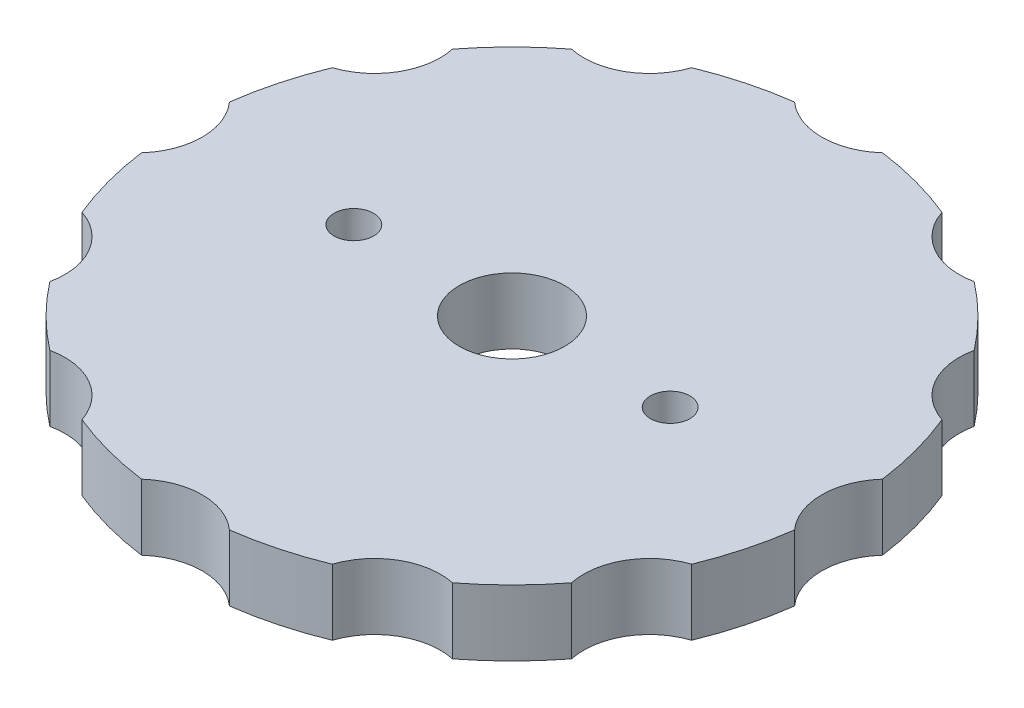
ISO-10303-21;
HEADER;
FILE_DESCRIPTION(('STEP AP214'),'2;1');
FILE_NAME('part.step','',(''),(''),'','','');
FILE_SCHEMA(('AUTOMOTIVE_DESIGN { 1 0 10303 214 1 1 1 1 }'));
ENDSEC;
DATA;
#1=APPLICATION_CONTEXT('core data for automotive mechanical design processes');
#2=APPLICATION_PROTOCOL_DEFINITION('international standard','automotive_design',2000,#1);
#3=PRODUCT_CONTEXT('',#1,'mechanical');
#4=PRODUCT('Part','Part','',(#3));
#5=PRODUCT_RELATED_PRODUCT_CATEGORY('part','',(#4));
#6=PRODUCT_DEFINITION_FORMATION('','',#4);
#7=PRODUCT_DEFINITION_CONTEXT('part definition',#1,'design');
#8=PRODUCT_DEFINITION('design','',#6,#7);
#9=PRODUCT_DEFINITION_SHAPE('','',#8);
#10=(LENGTH_UNIT() NAMED_UNIT(*) SI_UNIT(.MILLI.,.METRE.));
#11=(NAMED_UNIT(*) PLANE_ANGLE_UNIT() SI_UNIT($,.RADIAN.));
#12=(NAMED_UNIT(*) SI_UNIT($,.STERADIAN.) SOLID_ANGLE_UNIT());
#13=UNCERTAINTY_MEASURE_WITH_UNIT(LENGTH_MEASURE(1.E-05),#10,'distance_accuracy_value','');
#14=(GEOMETRIC_REPRESENTATION_CONTEXT(3) GLOBAL_UNCERTAINTY_ASSIGNED_CONTEXT((#13)) GLOBAL_UNIT_ASSIGNED_CONTEXT((#10,
#11,#12)) REPRESENTATION_CONTEXT('',''));
#15=CARTESIAN_POINT('',(0.,0.,0.));
#16=DIRECTION('',(0.,0.,1.));
#17=DIRECTION('',(1.,0.,0.));
#18=AXIS2_PLACEMENT_3D('',#15,#16,#17);
#19=CARTESIAN_POINT('',(0.,5.,0.));
#20=DIRECTION('',(0.,1.,0.));
#21=DIRECTION('',(0.,0.,1.));
#22=AXIS2_PLACEMENT_3D('',#19,#20,#21);
#23=PLANE('',#22);
#24=CARTESIAN_POINT('',(12.,5.,0.));
#25=DIRECTION('',(0.,1.,0.));
#26=DIRECTION('',(0.,0.,-1.));
#27=AXIS2_PLACEMENT_3D('',#24,#25,#26);
#28=CIRCLE('',#27,1.5);
#29=CARTESIAN_POINT('',(12.,5.,-1.5));
#30=VERTEX_POINT('',#29);
#31=EDGE_CURVE('E340',#30,#30,#28,.T.);
#32=ORIENTED_EDGE('',*,*,#31,.F.);
#33=EDGE_LOOP('',(#32));
#34=FACE_BOUND('',#33,.T.);
#35=CARTESIAN_POINT('',(-12.,5.,0.));
#36=DIRECTION('',(0.,1.,0.));
#37=DIRECTION('',(0.,0.,1.));
#38=AXIS2_PLACEMENT_3D('',#35,#36,#37);
#39=CIRCLE('',#38,1.5);
#40=CARTESIAN_POINT('',(-12.,5.,1.5));
#41=VERTEX_POINT('',#40);
#42=EDGE_CURVE('E334',#41,#41,#39,.T.);
#43=ORIENTED_EDGE('',*,*,#42,.F.);
#44=EDGE_LOOP('',(#43));
#45=FACE_BOUND('',#44,.T.);
#46=CARTESIAN_POINT('',(0.,5.,0.));
#47=DIRECTION('',(0.,1.,0.));
#48=DIRECTION('',(0.,0.,1.));
#49=AXIS2_PLACEMENT_3D('',#46,#47,#48);
#50=CIRCLE('',#49,25.);
#51=CARTESIAN_POINT('',(19.7885232568087,5.,-15.2779038913963));
#52=VERTEX_POINT('',#51);
#53=CARTESIAN_POINT('',(15.2779038913958,5.,-19.7885232568091));
#54=VERTEX_POINT('',#53);
#55=EDGE_CURVE('E205',#52,#54,#50,.T.);
#56=ORIENTED_EDGE('',*,*,#55,.T.);
#57=CARTESIAN_POINT('',(14.2499999999997,5.,-24.6817240078567));
#58=DIRECTION('',(0.,1.,0.));
#59=DIRECTION('',(-0.499999999999989,0.,0.866025403784445));
#60=AXIS2_PLACEMENT_3D('',#57,#58,#59);
#61=CIRCLE('',#60,5.);
#62=CARTESIAN_POINT('',(9.49841189807736,5.,-23.1253145149307));
#63=VERTEX_POINT('',#62);
#64=EDGE_CURVE('E191',#63,#54,#61,.T.);
#65=ORIENTED_EDGE('',*,*,#64,.F.);
#66=CARTESIAN_POINT('',(3.33679125812165,5.,-24.7763157894737));
#67=VERTEX_POINT('',#66);
#68=EDGE_CURVE('E214',#63,#67,#50,.T.);
#69=ORIENTED_EDGE('',*,*,#68,.T.);
#70=CARTESIAN_POINT('',(0.,5.,-28.5));
#71=DIRECTION('',(0.,1.,0.));
#72=DIRECTION('',(0.,0.,1.));
#73=AXIS2_PLACEMENT_3D('',#70,#71,#72);
#74=CIRCLE('',#73,5.);
#75=CARTESIAN_POINT('',(-3.33679125812165,5.,-24.7763157894737));
#76=VERTEX_POINT('',#75);
#77=EDGE_CURVE('E266',#76,#67,#74,.T.);
#78=ORIENTED_EDGE('',*,*,#77,.F.);
#79=CARTESIAN_POINT('',(-9.49841189807768,5.,-23.1253145149305));
#80=VERTEX_POINT('',#79);
#81=EDGE_CURVE('E218',#76,#80,#50,.T.);
#82=ORIENTED_EDGE('',*,*,#81,.T.);
#83=CARTESIAN_POINT('',(-14.25,5.,-24.6817240078565));
#84=DIRECTION('',(0.,1.,0.));
#85=DIRECTION('',(0.500000000000001,0.,0.866025403784438));
#86=AXIS2_PLACEMENT_3D('',#83,#84,#85);
#87=CIRCLE('',#86,5.);
#88=CARTESIAN_POINT('',(-15.2779038913961,5.,-19.7885232568089));
#89=VERTEX_POINT('',#88);
#90=EDGE_CURVE('E275',#89,#80,#87,.T.);
#91=ORIENTED_EDGE('',*,*,#90,.F.);
#92=CARTESIAN_POINT('',(-19.7885232568089,5.,-15.277903891396));
#93=VERTEX_POINT('',#92);
#94=EDGE_CURVE('E223',#89,#93,#50,.T.);
#95=ORIENTED_EDGE('',*,*,#94,.T.);
#96=CARTESIAN_POINT('',(-24.6817240078565,5.,-14.2499999999999));
#97=DIRECTION('',(0.,1.,0.));
#98=DIRECTION('',(0.86602540378444,0.,0.499999999999998));
#99=AXIS2_PLACEMENT_3D('',#96,#97,#98);
#100=CIRCLE('',#99,5.);
#101=CARTESIAN_POINT('',(-23.1253145149306,5.,-9.4984118980776));
#102=VERTEX_POINT('',#101);
#103=EDGE_CURVE('E281',#102,#93,#100,.T.);
#104=ORIENTED_EDGE('',*,*,#103,.F.);
#105=CARTESIAN_POINT('',(-24.7763157894737,5.,-3.33679125812157));
#106=VERTEX_POINT('',#105);
#107=EDGE_CURVE('E443',#102,#106,#50,.T.);
#108=ORIENTED_EDGE('',*,*,#107,.T.);
#109=CARTESIAN_POINT('',(-28.5,5.,0.));
#110=DIRECTION('',(0.,1.,0.));
#111=DIRECTION('',(1.,0.,0.));
#112=AXIS2_PLACEMENT_3D('',#109,#110,#111);
#113=CIRCLE('',#112,5.);
#114=CARTESIAN_POINT('',(-24.7763157894737,5.,3.33679125812174));
#115=VERTEX_POINT('',#114);
#116=EDGE_CURVE('E287',#115,#106,#113,.T.);
#117=ORIENTED_EDGE('',*,*,#116,.F.);
#118=CARTESIAN_POINT('',(-23.1253145149305,5.,9.49841189807777));
#119=VERTEX_POINT('',#118);
#120=EDGE_CURVE('E445',#115,#119,#50,.T.);
#121=ORIENTED_EDGE('',*,*,#120,.T.);
#122=CARTESIAN_POINT('',(-24.6817240078564,5.,14.2500000000001));
#123=DIRECTION('',(0.,1.,0.));
#124=DIRECTION('',(0.866025403784436,0.,-0.500000000000004));
#125=AXIS2_PLACEMENT_3D('',#122,#123,#124);
#126=CIRCLE('',#125,5.);
#127=CARTESIAN_POINT('',(-19.7885232568088,5.,15.2779038913961));
#128=VERTEX_POINT('',#127);
#129=EDGE_CURVE('E293',#128,#119,#126,.T.);
#130=ORIENTED_EDGE('',*,*,#129,.F.);
#131=CARTESIAN_POINT('',(-15.2779038913959,5.,19.788523256809));
#132=VERTEX_POINT('',#131);
#133=EDGE_CURVE('E449',#128,#132,#50,.T.);
#134=ORIENTED_EDGE('',*,*,#133,.T.);
#135=CARTESIAN_POINT('',(-14.2499999999999,5.,24.6817240078566));
#136=DIRECTION('',(0.,1.,0.));
#137=DIRECTION('',(0.499999999999995,0.,-0.866025403784442));
#138=AXIS2_PLACEMENT_3D('',#135,#136,#137);
#139=CIRCLE('',#138,5.);
#140=CARTESIAN_POINT('',(-9.49841189807752,5.,23.1253145149306));
#141=VERTEX_POINT('',#140);
#142=EDGE_CURVE('E299',#141,#132,#139,.T.);
#143=ORIENTED_EDGE('',*,*,#142,.F.);
#144=CARTESIAN_POINT('',(-3.33679125812165,5.,24.7763157894737));
#145=VERTEX_POINT('',#144);
#146=EDGE_CURVE('E453',#141,#145,#50,.T.);
#147=ORIENTED_EDGE('',*,*,#146,.T.);
#148=CARTESIAN_POINT('',(0.,5.,28.5));
#149=DIRECTION('',(0.,1.,0.));
#150=DIRECTION('',(0.,0.,-1.));
#151=AXIS2_PLACEMENT_3D('',#148,#149,#150);
#152=CIRCLE('',#151,5.);
#153=CARTESIAN_POINT('',(3.33679125812165,5.,24.7763157894737));
#154=VERTEX_POINT('',#153);
#155=EDGE_CURVE('E305',#154,#145,#152,.T.);
#156=ORIENTED_EDGE('',*,*,#155,.F.);
#157=CARTESIAN_POINT('',(9.49841189807785,5.,23.1253145149305));
#158=VERTEX_POINT('',#157);
#159=EDGE_CURVE('E457',#154,#158,#50,.T.);
#160=ORIENTED_EDGE('',*,*,#159,.T.);
#161=CARTESIAN_POINT('',(14.2500000000002,5.,24.6817240078564));
#162=DIRECTION('',(0.,1.,0.));
#163=DIRECTION('',(-0.500000000000007,0.,-0.866025403784435));
#164=AXIS2_PLACEMENT_3D('',#161,#162,#163);
#165=CIRCLE('',#164,5.);
#166=CARTESIAN_POINT('',(15.2779038913962,5.,19.7885232568088));
#167=VERTEX_POINT('',#166);
#168=EDGE_CURVE('E311',#167,#158,#165,.T.);
#169=ORIENTED_EDGE('',*,*,#168,.F.);
#170=CARTESIAN_POINT('',(19.788523256809,5.,15.2779038913958));
#171=VERTEX_POINT('',#170);
#172=EDGE_CURVE('E461',#167,#171,#50,.T.);
#173=ORIENTED_EDGE('',*,*,#172,.T.);
#174=CARTESIAN_POINT('',(24.6817240078566,5.,14.2499999999998));
#175=DIRECTION('',(0.,1.,0.));
#176=DIRECTION('',(-0.866025403784443,0.,-0.499999999999992));
#177=AXIS2_PLACEMENT_3D('',#174,#175,#176);
#178=CIRCLE('',#177,5.);
#179=CARTESIAN_POINT('',(23.1253145149306,5.,9.49841189807744));
#180=VERTEX_POINT('',#179);
#181=EDGE_CURVE('E317',#180,#171,#178,.T.);
#182=ORIENTED_EDGE('',*,*,#181,.F.);
#183=CARTESIAN_POINT('',(24.7763157894737,5.,3.33679125812139));
#184=VERTEX_POINT('',#183);
#185=EDGE_CURVE('E216',#180,#184,#50,.T.);
#186=ORIENTED_EDGE('',*,*,#185,.T.);
#187=CARTESIAN_POINT('',(28.5,5.,-2.98674735320981E-13));
#188=DIRECTION('',(0.,1.,0.));
#189=DIRECTION('',(-1.,0.,0.));
#190=AXIS2_PLACEMENT_3D('',#187,#188,#189);
#191=CIRCLE('',#190,5.);
#192=CARTESIAN_POINT('',(24.7763157894737,5.,-3.33679125812191));
#193=VERTEX_POINT('',#192);
#194=EDGE_CURVE('E323',#193,#184,#191,.T.);
#195=ORIENTED_EDGE('',*,*,#194,.F.);
#196=CARTESIAN_POINT('',(23.1253145149304,5.,-9.49841189807793));
#197=VERTEX_POINT('',#196);
#198=EDGE_CURVE('E213',#193,#197,#50,.T.);
#199=ORIENTED_EDGE('',*,*,#198,.T.);
#200=CARTESIAN_POINT('',(24.6817240078563,5.,-14.2500000000003));
#201=DIRECTION('',(0.,1.,0.));
#202=DIRECTION('',(-0.866025403784433,0.,0.50000000000001));
#203=AXIS2_PLACEMENT_3D('',#200,#201,#202);
#204=CIRCLE('',#203,5.);
#205=EDGE_CURVE('E208',#52,#197,#204,.T.);
#206=ORIENTED_EDGE('',*,*,#205,.F.);
#207=EDGE_LOOP('',(#56,#65,#69,#78,#82,#91,#95,#104,#108,#117,#121,#130,#134,#143,#147,#156,
#160,#169,#173,#182,#186,#195,#199,#206));
#208=FACE_BOUND('',#207,.T.);
#209=CARTESIAN_POINT('',(0.,5.,0.));
#210=DIRECTION('',(0.,1.,0.));
#211=DIRECTION('',(0.,0.,1.));
#212=AXIS2_PLACEMENT_3D('',#209,#210,#211);
#213=CIRCLE('',#212,4.);
#214=CARTESIAN_POINT('',(0.,5.,4.));
#215=VERTEX_POINT('',#214);
#216=EDGE_CURVE('E198',#215,#215,#213,.T.);
#217=ORIENTED_EDGE('',*,*,#216,.F.);
#218=EDGE_LOOP('',(#217));
#219=FACE_BOUND('',#218,.T.);
#220=ADVANCED_FACE('F33',(#34,#45,#208,#219),#23,.T.);
#221=CARTESIAN_POINT('',(0.,0.,0.));
#222=DIRECTION('',(0.,1.,0.));
#223=DIRECTION('',(0.,0.,1.));
#224=AXIS2_PLACEMENT_3D('',#221,#222,#223);
#225=PLANE('',#224);
#226=CARTESIAN_POINT('',(12.,0.,0.));
#227=DIRECTION('',(0.,1.,0.));
#228=DIRECTION('',(0.,0.,-1.));
#229=AXIS2_PLACEMENT_3D('',#226,#227,#228);
#230=CIRCLE('',#229,1.5);
#231=CARTESIAN_POINT('',(12.,0.,-1.5));
#232=VERTEX_POINT('',#231);
#233=EDGE_CURVE('E337',#232,#232,#230,.T.);
#234=ORIENTED_EDGE('',*,*,#233,.T.);
#235=EDGE_LOOP('',(#234));
#236=FACE_BOUND('',#235,.T.);
#237=CARTESIAN_POINT('',(-12.,0.,0.));
#238=DIRECTION('',(0.,1.,0.));
#239=DIRECTION('',(0.,0.,1.));
#240=AXIS2_PLACEMENT_3D('',#237,#238,#239);
#241=CIRCLE('',#240,1.5);
#242=CARTESIAN_POINT('',(-12.,0.,1.5));
#243=VERTEX_POINT('',#242);
#244=EDGE_CURVE('E331',#243,#243,#241,.T.);
#245=ORIENTED_EDGE('',*,*,#244,.T.);
#246=EDGE_LOOP('',(#245));
#247=FACE_BOUND('',#246,.T.);
#248=CARTESIAN_POINT('',(14.2499999999997,0.,-24.6817240078567));
#249=DIRECTION('',(0.,1.,0.));
#250=DIRECTION('',(0.,0.,1.));
#251=AXIS2_PLACEMENT_3D('',#248,#249,#250);
#252=CIRCLE('',#251,5.);
#253=CARTESIAN_POINT('',(15.2779038913958,0.,-19.7885232568091));
#254=VERTEX_POINT('',#253);
#255=CARTESIAN_POINT('',(9.49841189807736,0.,-23.1253145149307));
#256=VERTEX_POINT('',#255);
#257=EDGE_CURVE('E11',#254,#256,#252,.F.);
#258=ORIENTED_EDGE('',*,*,#257,.F.);
#259=CARTESIAN_POINT('',(0.,0.,0.));
#260=DIRECTION('',(0.,1.,0.));
#261=DIRECTION('',(0.,0.,1.));
#262=AXIS2_PLACEMENT_3D('',#259,#260,#261);
#263=CIRCLE('',#262,25.);
#264=CARTESIAN_POINT('',(19.7885232568087,0.,-15.2779038913963));
#265=VERTEX_POINT('',#264);
#266=EDGE_CURVE('E207',#265,#254,#263,.T.);
#267=ORIENTED_EDGE('',*,*,#266,.F.);
#268=CARTESIAN_POINT('',(24.6817240078563,0.,-14.2500000000003));
#269=DIRECTION('',(0.,1.,0.));
#270=DIRECTION('',(0.,0.,1.));
#271=AXIS2_PLACEMENT_3D('',#268,#269,#270);
#272=CIRCLE('',#271,5.);
#273=CARTESIAN_POINT('',(23.1253145149304,0.,-9.49841189807792));
#274=VERTEX_POINT('',#273);
#275=EDGE_CURVE('E41',#274,#265,#272,.F.);
#276=ORIENTED_EDGE('',*,*,#275,.F.);
#277=CARTESIAN_POINT('',(24.7763157894737,0.,-3.33679125812191));
#278=VERTEX_POINT('',#277);
#279=EDGE_CURVE('E257',#278,#274,#263,.T.);
#280=ORIENTED_EDGE('',*,*,#279,.F.);
#281=CARTESIAN_POINT('',(28.5,0.,-2.98674735320981E-13));
#282=DIRECTION('',(0.,1.,0.));
#283=DIRECTION('',(0.,0.,1.));
#284=AXIS2_PLACEMENT_3D('',#281,#282,#283);
#285=CIRCLE('',#284,5.);
#286=CARTESIAN_POINT('',(24.7763157894737,0.,3.33679125812139));
#287=VERTEX_POINT('',#286);
#288=EDGE_CURVE('E247',#287,#278,#285,.F.);
#289=ORIENTED_EDGE('',*,*,#288,.F.);
#290=CARTESIAN_POINT('',(23.1253145149306,0.,9.49841189807744));
#291=VERTEX_POINT('',#290);
#292=EDGE_CURVE('E258',#291,#287,#263,.T.);
#293=ORIENTED_EDGE('',*,*,#292,.F.);
#294=CARTESIAN_POINT('',(24.6817240078566,0.,14.2499999999998));
#295=DIRECTION('',(0.,1.,0.));
#296=DIRECTION('',(0.,0.,1.));
#297=AXIS2_PLACEMENT_3D('',#294,#295,#296);
#298=CIRCLE('',#297,5.);
#299=CARTESIAN_POINT('',(19.788523256809,0.,15.2779038913958));
#300=VERTEX_POINT('',#299);
#301=EDGE_CURVE('E245',#300,#291,#298,.F.);
#302=ORIENTED_EDGE('',*,*,#301,.F.);
#303=CARTESIAN_POINT('',(15.2779038913962,0.,19.7885232568088));
#304=VERTEX_POINT('',#303);
#305=EDGE_CURVE('E500',#304,#300,#263,.T.);
#306=ORIENTED_EDGE('',*,*,#305,.F.);
#307=CARTESIAN_POINT('',(14.2500000000002,0.,24.6817240078564));
#308=DIRECTION('',(0.,1.,0.));
#309=DIRECTION('',(0.,0.,1.));
#310=AXIS2_PLACEMENT_3D('',#307,#308,#309);
#311=CIRCLE('',#310,5.);
#312=CARTESIAN_POINT('',(9.49841189807786,0.,23.1253145149305));
#313=VERTEX_POINT('',#312);
#314=EDGE_CURVE('E243',#313,#304,#311,.F.);
#315=ORIENTED_EDGE('',*,*,#314,.F.);
#316=CARTESIAN_POINT('',(3.33679125812165,0.,24.7763157894737));
#317=VERTEX_POINT('',#316);
#318=EDGE_CURVE('E504',#317,#313,#263,.T.);
#319=ORIENTED_EDGE('',*,*,#318,.F.);
#320=CARTESIAN_POINT('',(0.,0.,28.5));
#321=DIRECTION('',(0.,1.,0.));
#322=DIRECTION('',(0.,0.,1.));
#323=AXIS2_PLACEMENT_3D('',#320,#321,#322);
#324=CIRCLE('',#323,5.);
#325=CARTESIAN_POINT('',(-3.33679125812165,0.,24.7763157894737));
#326=VERTEX_POINT('',#325);
#327=EDGE_CURVE('E241',#326,#317,#324,.F.);
#328=ORIENTED_EDGE('',*,*,#327,.F.);
#329=CARTESIAN_POINT('',(-9.49841189807752,0.,23.1253145149306));
#330=VERTEX_POINT('',#329);
#331=EDGE_CURVE('E505',#330,#326,#263,.T.);
#332=ORIENTED_EDGE('',*,*,#331,.F.);
#333=CARTESIAN_POINT('',(-14.2499999999999,0.,24.6817240078566));
#334=DIRECTION('',(0.,1.,0.));
#335=DIRECTION('',(0.,0.,1.));
#336=AXIS2_PLACEMENT_3D('',#333,#334,#335);
#337=CIRCLE('',#336,5.);
#338=CARTESIAN_POINT('',(-15.2779038913959,0.,19.788523256809));
#339=VERTEX_POINT('',#338);
#340=EDGE_CURVE('E239',#339,#330,#337,.F.);
#341=ORIENTED_EDGE('',*,*,#340,.F.);
#342=CARTESIAN_POINT('',(-19.7885232568088,0.,15.2779038913961));
#343=VERTEX_POINT('',#342);
#344=EDGE_CURVE('E509',#343,#339,#263,.T.);
#345=ORIENTED_EDGE('',*,*,#344,.F.);
#346=CARTESIAN_POINT('',(-24.6817240078564,0.,14.2500000000001));
#347=DIRECTION('',(0.,1.,0.));
#348=DIRECTION('',(0.,0.,1.));
#349=AXIS2_PLACEMENT_3D('',#346,#347,#348);
#350=CIRCLE('',#349,5.);
#351=CARTESIAN_POINT('',(-23.1253145149305,0.,9.49841189807778));
#352=VERTEX_POINT('',#351);
#353=EDGE_CURVE('E237',#352,#343,#350,.F.);
#354=ORIENTED_EDGE('',*,*,#353,.F.);
#355=CARTESIAN_POINT('',(-24.7763157894737,0.,3.33679125812174));
#356=VERTEX_POINT('',#355);
#357=EDGE_CURVE('E515',#356,#352,#263,.T.);
#358=ORIENTED_EDGE('',*,*,#357,.F.);
#359=CARTESIAN_POINT('',(-28.5,0.,0.));
#360=DIRECTION('',(0.,1.,0.));
#361=DIRECTION('',(0.,0.,1.));
#362=AXIS2_PLACEMENT_3D('',#359,#360,#361);
#363=CIRCLE('',#362,5.);
#364=CARTESIAN_POINT('',(-24.7763157894737,0.,-3.33679125812157));
#365=VERTEX_POINT('',#364);
#366=EDGE_CURVE('E235',#365,#356,#363,.F.);
#367=ORIENTED_EDGE('',*,*,#366,.F.);
#368=CARTESIAN_POINT('',(-23.1253145149306,0.,-9.4984118980776));
#369=VERTEX_POINT('',#368);
#370=EDGE_CURVE('E521',#369,#365,#263,.T.);
#371=ORIENTED_EDGE('',*,*,#370,.F.);
#372=CARTESIAN_POINT('',(-24.6817240078565,0.,-14.2499999999999));
#373=DIRECTION('',(0.,1.,0.));
#374=DIRECTION('',(0.,0.,1.));
#375=AXIS2_PLACEMENT_3D('',#372,#373,#374);
#376=CIRCLE('',#375,5.);
#377=CARTESIAN_POINT('',(-19.7885232568089,0.,-15.277903891396));
#378=VERTEX_POINT('',#377);
#379=EDGE_CURVE('E233',#378,#369,#376,.F.);
#380=ORIENTED_EDGE('',*,*,#379,.F.);
#381=CARTESIAN_POINT('',(-15.2779038913961,0.,-19.7885232568089));
#382=VERTEX_POINT('',#381);
#383=EDGE_CURVE('E228',#382,#378,#263,.T.);
#384=ORIENTED_EDGE('',*,*,#383,.F.);
#385=CARTESIAN_POINT('',(-14.25,0.,-24.6817240078565));
#386=DIRECTION('',(0.,1.,0.));
#387=DIRECTION('',(0.,0.,1.));
#388=AXIS2_PLACEMENT_3D('',#385,#386,#387);
#389=CIRCLE('',#388,5.);
#390=CARTESIAN_POINT('',(-9.49841189807768,0.,-23.1253145149305));
#391=VERTEX_POINT('',#390);
#392=EDGE_CURVE('E231',#391,#382,#389,.F.);
#393=ORIENTED_EDGE('',*,*,#392,.F.);
#394=CARTESIAN_POINT('',(-3.33679125812165,0.,-24.7763157894737));
#395=VERTEX_POINT('',#394);
#396=EDGE_CURVE('E217',#395,#391,#263,.T.);
#397=ORIENTED_EDGE('',*,*,#396,.F.);
#398=CARTESIAN_POINT('',(0.,0.,-28.5));
#399=DIRECTION('',(0.,1.,0.));
#400=DIRECTION('',(0.,0.,1.));
#401=AXIS2_PLACEMENT_3D('',#398,#399,#400);
#402=CIRCLE('',#401,5.);
#403=CARTESIAN_POINT('',(3.33679125812165,0.,-24.7763157894737));
#404=VERTEX_POINT('',#403);
#405=EDGE_CURVE('E222',#404,#395,#402,.F.);
#406=ORIENTED_EDGE('',*,*,#405,.F.);
#407=EDGE_CURVE('E229',#256,#404,#263,.T.);
#408=ORIENTED_EDGE('',*,*,#407,.F.);
#409=EDGE_LOOP('',(#258,#267,#276,#280,#289,#293,#302,#306,#315,#319,#328,#332,#341,#345,#354,
#358,#367,#371,#380,#384,#393,#397,#406,#408));
#410=FACE_BOUND('',#409,.T.);
#411=CARTESIAN_POINT('',(0.,0.,0.));
#412=DIRECTION('',(0.,1.,0.));
#413=DIRECTION('',(0.,0.,1.));
#414=AXIS2_PLACEMENT_3D('',#411,#412,#413);
#415=CIRCLE('',#414,4.);
#416=CARTESIAN_POINT('',(0.,0.,4.));
#417=VERTEX_POINT('',#416);
#418=EDGE_CURVE('E328',#417,#417,#415,.T.);
#419=ORIENTED_EDGE('',*,*,#418,.T.);
#420=EDGE_LOOP('',(#419));
#421=FACE_BOUND('',#420,.T.);
#422=ADVANCED_FACE('F254',(#236,#247,#410,#421),#225,.F.);
#423=CARTESIAN_POINT('',(0.,5.,0.));
#424=DIRECTION('',(0.,-1.,0.));
#425=DIRECTION('',(0.,0.,-1.));
#426=AXIS2_PLACEMENT_3D('',#423,#424,#425);
#427=CYLINDRICAL_SURFACE('',#426,25.);
#428=DIRECTION('',(0.,-1.,0.));
#429=VECTOR('',#428,1.);
#430=CARTESIAN_POINT('',(15.2779038913958,2.5,-19.7885232568091));
#431=LINE('',#430,#429);
#432=EDGE_CURVE('E47',#54,#254,#431,.T.);
#433=ORIENTED_EDGE('',*,*,#432,.F.);
#434=ORIENTED_EDGE('',*,*,#55,.F.);
#435=DIRECTION('',(0.,-1.,0.));
#436=VECTOR('',#435,1.);
#437=CARTESIAN_POINT('',(19.7885232568087,2.5,-15.2779038913963));
#438=LINE('',#437,#436);
#439=EDGE_CURVE('E249',#265,#52,#438,.F.);
#440=ORIENTED_EDGE('',*,*,#439,.F.);
#441=ORIENTED_EDGE('',*,*,#266,.T.);
#442=EDGE_LOOP('',(#433,#434,#440,#441));
#443=FACE_BOUND('',#442,.T.);
#444=ADVANCED_FACE('F203',(#443),#427,.T.);
#445=DIRECTION('',(0.,-1.,0.));
#446=VECTOR('',#445,1.);
#447=CARTESIAN_POINT('',(9.49841189807736,2.5,-23.1253145149307));
#448=LINE('',#447,#446);
#449=EDGE_CURVE('E194',#256,#63,#448,.F.);
#450=ORIENTED_EDGE('',*,*,#449,.F.);
#451=ORIENTED_EDGE('',*,*,#407,.T.);
#452=DIRECTION('',(0.,-1.,0.));
#453=VECTOR('',#452,1.);
#454=CARTESIAN_POINT('',(3.33679125812165,2.5,-24.7763157894737));
#455=LINE('',#454,#453);
#456=EDGE_CURVE('E224',#67,#404,#455,.T.);
#457=ORIENTED_EDGE('',*,*,#456,.F.);
#458=ORIENTED_EDGE('',*,*,#68,.F.);
#459=EDGE_LOOP('',(#450,#451,#457,#458));
#460=FACE_BOUND('',#459,.T.);
#461=ADVANCED_FACE('F417',(#460),#427,.T.);
#462=DIRECTION('',(0.,-1.,0.));
#463=VECTOR('',#462,1.);
#464=CARTESIAN_POINT('',(23.1253145149304,2.5,-9.49841189807793));
#465=LINE('',#464,#463);
#466=EDGE_CURVE('E55',#197,#274,#465,.T.);
#467=ORIENTED_EDGE('',*,*,#466,.F.);
#468=ORIENTED_EDGE('',*,*,#198,.F.);
#469=DIRECTION('',(0.,-1.,0.));
#470=VECTOR('',#469,1.);
#471=CARTESIAN_POINT('',(24.7763157894737,2.5,-3.33679125812191));
#472=LINE('',#471,#470);
#473=EDGE_CURVE('E321',#278,#193,#472,.F.);
#474=ORIENTED_EDGE('',*,*,#473,.F.);
#475=ORIENTED_EDGE('',*,*,#279,.T.);
#476=EDGE_LOOP('',(#467,#468,#474,#475));
#477=FACE_BOUND('',#476,.T.);
#478=ADVANCED_FACE('F421',(#477),#427,.T.);
#479=DIRECTION('',(0.,-1.,0.));
#480=VECTOR('',#479,1.);
#481=CARTESIAN_POINT('',(24.7763157894737,2.5,3.33679125812139));
#482=LINE('',#481,#480);
#483=EDGE_CURVE('E319',#184,#287,#482,.T.);
#484=ORIENTED_EDGE('',*,*,#483,.F.);
#485=ORIENTED_EDGE('',*,*,#185,.F.);
#486=DIRECTION('',(0.,-1.,0.));
#487=VECTOR('',#486,1.);
#488=CARTESIAN_POINT('',(23.1253145149306,2.5,9.49841189807744));
#489=LINE('',#488,#487);
#490=EDGE_CURVE('E315',#291,#180,#489,.F.);
#491=ORIENTED_EDGE('',*,*,#490,.F.);
#492=ORIENTED_EDGE('',*,*,#292,.T.);
#493=EDGE_LOOP('',(#484,#485,#491,#492));
#494=FACE_BOUND('',#493,.T.);
#495=ADVANCED_FACE('F474',(#494),#427,.T.);
#496=DIRECTION('',(0.,-1.,0.));
#497=VECTOR('',#496,1.);
#498=CARTESIAN_POINT('',(19.788523256809,2.5,15.2779038913958));
#499=LINE('',#498,#497);
#500=EDGE_CURVE('E313',#171,#300,#499,.T.);
#501=ORIENTED_EDGE('',*,*,#500,.F.);
#502=ORIENTED_EDGE('',*,*,#172,.F.);
#503=DIRECTION('',(0.,-1.,0.));
#504=VECTOR('',#503,1.);
#505=CARTESIAN_POINT('',(15.2779038913962,2.5,19.7885232568088));
#506=LINE('',#505,#504);
#507=EDGE_CURVE('E309',#304,#167,#506,.F.);
#508=ORIENTED_EDGE('',*,*,#507,.F.);
#509=ORIENTED_EDGE('',*,*,#305,.T.);
#510=EDGE_LOOP('',(#501,#502,#508,#509));
#511=FACE_BOUND('',#510,.T.);
#512=ADVANCED_FACE('F485',(#511),#427,.T.);
#513=DIRECTION('',(0.,-1.,0.));
#514=VECTOR('',#513,1.);
#515=CARTESIAN_POINT('',(9.49841189807785,2.5,23.1253145149305));
#516=LINE('',#515,#514);
#517=EDGE_CURVE('E307',#158,#313,#516,.T.);
#518=ORIENTED_EDGE('',*,*,#517,.F.);
#519=ORIENTED_EDGE('',*,*,#159,.F.);
#520=DIRECTION('',(0.,-1.,0.));
#521=VECTOR('',#520,1.);
#522=CARTESIAN_POINT('',(3.33679125812165,2.5,24.7763157894737));
#523=LINE('',#522,#521);
#524=EDGE_CURVE('E303',#317,#154,#523,.F.);
#525=ORIENTED_EDGE('',*,*,#524,.F.);
#526=ORIENTED_EDGE('',*,*,#318,.T.);
#527=EDGE_LOOP('',(#518,#519,#525,#526));
#528=FACE_BOUND('',#527,.T.);
#529=ADVANCED_FACE('F489',(#528),#427,.T.);
#530=DIRECTION('',(0.,-1.,0.));
#531=VECTOR('',#530,1.);
#532=CARTESIAN_POINT('',(-3.33679125812165,2.5,24.7763157894737));
#533=LINE('',#532,#531);
#534=EDGE_CURVE('E301',#145,#326,#533,.T.);
#535=ORIENTED_EDGE('',*,*,#534,.F.);
#536=ORIENTED_EDGE('',*,*,#146,.F.);
#537=DIRECTION('',(0.,-1.,0.));
#538=VECTOR('',#537,1.);
#539=CARTESIAN_POINT('',(-9.49841189807752,2.5,23.1253145149306));
#540=LINE('',#539,#538);
#541=EDGE_CURVE('E297',#330,#141,#540,.F.);
#542=ORIENTED_EDGE('',*,*,#541,.F.);
#543=ORIENTED_EDGE('',*,*,#331,.T.);
#544=EDGE_LOOP('',(#535,#536,#542,#543));
#545=FACE_BOUND('',#544,.T.);
#546=ADVANCED_FACE('F494',(#545),#427,.T.);
#547=DIRECTION('',(0.,-1.,0.));
#548=VECTOR('',#547,1.);
#549=CARTESIAN_POINT('',(-15.2779038913959,2.5,19.788523256809));
#550=LINE('',#549,#548);
#551=EDGE_CURVE('E295',#132,#339,#550,.T.);
#552=ORIENTED_EDGE('',*,*,#551,.F.);
#553=ORIENTED_EDGE('',*,*,#133,.F.);
#554=DIRECTION('',(0.,-1.,0.));
#555=VECTOR('',#554,1.);
#556=CARTESIAN_POINT('',(-19.7885232568088,2.5,15.2779038913961));
#557=LINE('',#556,#555);
#558=EDGE_CURVE('E291',#343,#128,#557,.F.);
#559=ORIENTED_EDGE('',*,*,#558,.F.);
#560=ORIENTED_EDGE('',*,*,#344,.T.);
#561=EDGE_LOOP('',(#552,#553,#559,#560));
#562=FACE_BOUND('',#561,.T.);
#563=ADVANCED_FACE('F537',(#562),#427,.T.);
#564=DIRECTION('',(0.,-1.,0.));
#565=VECTOR('',#564,1.);
#566=CARTESIAN_POINT('',(-23.1253145149305,2.5,9.49841189807777));
#567=LINE('',#566,#565);
#568=EDGE_CURVE('E289',#119,#352,#567,.T.);
#569=ORIENTED_EDGE('',*,*,#568,.F.);
#570=ORIENTED_EDGE('',*,*,#120,.F.);
#571=DIRECTION('',(0.,-1.,0.));
#572=VECTOR('',#571,1.);
#573=CARTESIAN_POINT('',(-24.7763157894737,2.5,3.33679125812174));
#574=LINE('',#573,#572);
#575=EDGE_CURVE('E285',#356,#115,#574,.F.);
#576=ORIENTED_EDGE('',*,*,#575,.F.);
#577=ORIENTED_EDGE('',*,*,#357,.T.);
#578=EDGE_LOOP('',(#569,#570,#576,#577));
#579=FACE_BOUND('',#578,.T.);
#580=ADVANCED_FACE('F533',(#579),#427,.T.);
#581=DIRECTION('',(0.,-1.,0.));
#582=VECTOR('',#581,1.);
#583=CARTESIAN_POINT('',(-24.7763157894737,2.5,-3.33679125812156));
#584=LINE('',#583,#582);
#585=EDGE_CURVE('E283',#106,#365,#584,.T.);
#586=ORIENTED_EDGE('',*,*,#585,.F.);
#587=ORIENTED_EDGE('',*,*,#107,.F.);
#588=DIRECTION('',(0.,-1.,0.));
#589=VECTOR('',#588,1.);
#590=CARTESIAN_POINT('',(-23.1253145149306,2.5,-9.4984118980776));
#591=LINE('',#590,#589);
#592=EDGE_CURVE('E279',#369,#102,#591,.F.);
#593=ORIENTED_EDGE('',*,*,#592,.F.);
#594=ORIENTED_EDGE('',*,*,#370,.T.);
#595=EDGE_LOOP('',(#586,#587,#593,#594));
#596=FACE_BOUND('',#595,.T.);
#597=ADVANCED_FACE('F428',(#596),#427,.T.);
#598=DIRECTION('',(0.,-1.,0.));
#599=VECTOR('',#598,1.);
#600=CARTESIAN_POINT('',(-19.7885232568089,2.5,-15.277903891396));
#601=LINE('',#600,#599);
#602=EDGE_CURVE('E277',#93,#378,#601,.T.);
#603=ORIENTED_EDGE('',*,*,#602,.F.);
#604=ORIENTED_EDGE('',*,*,#94,.F.);
#605=DIRECTION('',(0.,-1.,0.));
#606=VECTOR('',#605,1.);
#607=CARTESIAN_POINT('',(-15.2779038913961,2.5,-19.7885232568089));
#608=LINE('',#607,#606);
#609=EDGE_CURVE('E273',#382,#89,#608,.F.);
#610=ORIENTED_EDGE('',*,*,#609,.F.);
#611=ORIENTED_EDGE('',*,*,#383,.T.);
#612=EDGE_LOOP('',(#603,#604,#610,#611));
#613=FACE_BOUND('',#612,.T.);
#614=ADVANCED_FACE('F423',(#613),#427,.T.);
#615=DIRECTION('',(0.,-1.,0.));
#616=VECTOR('',#615,1.);
#617=CARTESIAN_POINT('',(-9.49841189807768,2.5,-23.1253145149305));
#618=LINE('',#617,#616);
#619=EDGE_CURVE('E269',#80,#391,#618,.T.);
#620=ORIENTED_EDGE('',*,*,#619,.F.);
#621=ORIENTED_EDGE('',*,*,#81,.F.);
#622=DIRECTION('',(0.,-1.,0.));
#623=VECTOR('',#622,1.);
#624=CARTESIAN_POINT('',(-3.33679125812165,2.5,-24.7763157894737));
#625=LINE('',#624,#623);
#626=EDGE_CURVE('E262',#395,#76,#625,.F.);
#627=ORIENTED_EDGE('',*,*,#626,.F.);
#628=ORIENTED_EDGE('',*,*,#396,.T.);
#629=EDGE_LOOP('',(#620,#621,#627,#628));
#630=FACE_BOUND('',#629,.T.);
#631=ADVANCED_FACE('F35',(#630),#427,.T.);
#632=CARTESIAN_POINT('',(0.,5.,-28.5));
#633=DIRECTION('',(0.,-1.,0.));
#634=DIRECTION('',(0.,0.,-1.));
#635=AXIS2_PLACEMENT_3D('',#632,#633,#634);
#636=CYLINDRICAL_SURFACE('',#635,5.);
#637=ORIENTED_EDGE('',*,*,#456,.T.);
#638=ORIENTED_EDGE('',*,*,#405,.T.);
#639=ORIENTED_EDGE('',*,*,#626,.T.);
#640=ORIENTED_EDGE('',*,*,#77,.T.);
#641=EDGE_LOOP('',(#637,#638,#639,#640));
#642=FACE_BOUND('',#641,.T.);
#643=ADVANCED_FACE('F410',(#642),#636,.F.);
#644=CARTESIAN_POINT('',(-14.25,5.,-24.6817240078565));
#645=DIRECTION('',(0.,-1.,0.));
#646=DIRECTION('',(0.,0.,-1.));
#647=AXIS2_PLACEMENT_3D('',#644,#645,#646);
#648=CYLINDRICAL_SURFACE('',#647,5.);
#649=ORIENTED_EDGE('',*,*,#619,.T.);
#650=ORIENTED_EDGE('',*,*,#392,.T.);
#651=ORIENTED_EDGE('',*,*,#609,.T.);
#652=ORIENTED_EDGE('',*,*,#90,.T.);
#653=EDGE_LOOP('',(#649,#650,#651,#652));
#654=FACE_BOUND('',#653,.T.);
#655=ADVANCED_FACE('F406',(#654),#648,.F.);
#656=CARTESIAN_POINT('',(-24.6817240078565,5.,-14.2499999999999));
#657=DIRECTION('',(0.,-1.,0.));
#658=DIRECTION('',(0.,0.,-1.));
#659=AXIS2_PLACEMENT_3D('',#656,#657,#658);
#660=CYLINDRICAL_SURFACE('',#659,5.);
#661=ORIENTED_EDGE('',*,*,#602,.T.);
#662=ORIENTED_EDGE('',*,*,#379,.T.);
#663=ORIENTED_EDGE('',*,*,#592,.T.);
#664=ORIENTED_EDGE('',*,*,#103,.T.);
#665=EDGE_LOOP('',(#661,#662,#663,#664));
#666=FACE_BOUND('',#665,.T.);
#667=ADVANCED_FACE('F402',(#666),#660,.F.);
#668=CARTESIAN_POINT('',(-28.5,5.,0.));
#669=DIRECTION('',(0.,-1.,0.));
#670=DIRECTION('',(0.,0.,-1.));
#671=AXIS2_PLACEMENT_3D('',#668,#669,#670);
#672=CYLINDRICAL_SURFACE('',#671,5.);
#673=ORIENTED_EDGE('',*,*,#585,.T.);
#674=ORIENTED_EDGE('',*,*,#366,.T.);
#675=ORIENTED_EDGE('',*,*,#575,.T.);
#676=ORIENTED_EDGE('',*,*,#116,.T.);
#677=EDGE_LOOP('',(#673,#674,#675,#676));
#678=FACE_BOUND('',#677,.T.);
#679=ADVANCED_FACE('F398',(#678),#672,.F.);
#680=CARTESIAN_POINT('',(-24.6817240078564,5.,14.2500000000001));
#681=DIRECTION('',(0.,-1.,0.));
#682=DIRECTION('',(0.,0.,-1.));
#683=AXIS2_PLACEMENT_3D('',#680,#681,#682);
#684=CYLINDRICAL_SURFACE('',#683,5.);
#685=ORIENTED_EDGE('',*,*,#568,.T.);
#686=ORIENTED_EDGE('',*,*,#353,.T.);
#687=ORIENTED_EDGE('',*,*,#558,.T.);
#688=ORIENTED_EDGE('',*,*,#129,.T.);
#689=EDGE_LOOP('',(#685,#686,#687,#688));
#690=FACE_BOUND('',#689,.T.);
#691=ADVANCED_FACE('F394',(#690),#684,.F.);
#692=CARTESIAN_POINT('',(-14.2499999999999,5.,24.6817240078566));
#693=DIRECTION('',(0.,-1.,0.));
#694=DIRECTION('',(0.,0.,-1.));
#695=AXIS2_PLACEMENT_3D('',#692,#693,#694);
#696=CYLINDRICAL_SURFACE('',#695,5.);
#697=ORIENTED_EDGE('',*,*,#551,.T.);
#698=ORIENTED_EDGE('',*,*,#340,.T.);
#699=ORIENTED_EDGE('',*,*,#541,.T.);
#700=ORIENTED_EDGE('',*,*,#142,.T.);
#701=EDGE_LOOP('',(#697,#698,#699,#700));
#702=FACE_BOUND('',#701,.T.);
#703=ADVANCED_FACE('F390',(#702),#696,.F.);
#704=CARTESIAN_POINT('',(0.,5.,28.5));
#705=DIRECTION('',(0.,-1.,0.));
#706=DIRECTION('',(0.,0.,-1.));
#707=AXIS2_PLACEMENT_3D('',#704,#705,#706);
#708=CYLINDRICAL_SURFACE('',#707,5.);
#709=ORIENTED_EDGE('',*,*,#534,.T.);
#710=ORIENTED_EDGE('',*,*,#327,.T.);
#711=ORIENTED_EDGE('',*,*,#524,.T.);
#712=ORIENTED_EDGE('',*,*,#155,.T.);
#713=EDGE_LOOP('',(#709,#710,#711,#712));
#714=FACE_BOUND('',#713,.T.);
#715=ADVANCED_FACE('F386',(#714),#708,.F.);
#716=CARTESIAN_POINT('',(14.2500000000002,5.,24.6817240078564));
#717=DIRECTION('',(0.,-1.,0.));
#718=DIRECTION('',(0.,0.,-1.));
#719=AXIS2_PLACEMENT_3D('',#716,#717,#718);
#720=CYLINDRICAL_SURFACE('',#719,5.);
#721=ORIENTED_EDGE('',*,*,#517,.T.);
#722=ORIENTED_EDGE('',*,*,#314,.T.);
#723=ORIENTED_EDGE('',*,*,#507,.T.);
#724=ORIENTED_EDGE('',*,*,#168,.T.);
#725=EDGE_LOOP('',(#721,#722,#723,#724));
#726=FACE_BOUND('',#725,.T.);
#727=ADVANCED_FACE('F382',(#726),#720,.F.);
#728=CARTESIAN_POINT('',(24.6817240078566,5.,14.2499999999998));
#729=DIRECTION('',(0.,-1.,0.));
#730=DIRECTION('',(0.,0.,-1.));
#731=AXIS2_PLACEMENT_3D('',#728,#729,#730);
#732=CYLINDRICAL_SURFACE('',#731,5.);
#733=ORIENTED_EDGE('',*,*,#500,.T.);
#734=ORIENTED_EDGE('',*,*,#301,.T.);
#735=ORIENTED_EDGE('',*,*,#490,.T.);
#736=ORIENTED_EDGE('',*,*,#181,.T.);
#737=EDGE_LOOP('',(#733,#734,#735,#736));
#738=FACE_BOUND('',#737,.T.);
#739=ADVANCED_FACE('F378',(#738),#732,.F.);
#740=CARTESIAN_POINT('',(28.5,5.,-2.98674735320981E-13));
#741=DIRECTION('',(0.,-1.,0.));
#742=DIRECTION('',(0.,0.,-1.));
#743=AXIS2_PLACEMENT_3D('',#740,#741,#742);
#744=CYLINDRICAL_SURFACE('',#743,5.);
#745=ORIENTED_EDGE('',*,*,#483,.T.);
#746=ORIENTED_EDGE('',*,*,#288,.T.);
#747=ORIENTED_EDGE('',*,*,#473,.T.);
#748=ORIENTED_EDGE('',*,*,#194,.T.);
#749=EDGE_LOOP('',(#745,#746,#747,#748));
#750=FACE_BOUND('',#749,.T.);
#751=ADVANCED_FACE('F375',(#750),#744,.F.);
#752=CARTESIAN_POINT('',(24.6817240078563,5.,-14.2500000000003));
#753=DIRECTION('',(0.,-1.,0.));
#754=DIRECTION('',(0.,0.,-1.));
#755=AXIS2_PLACEMENT_3D('',#752,#753,#754);
#756=CYLINDRICAL_SURFACE('',#755,5.);
#757=ORIENTED_EDGE('',*,*,#466,.T.);
#758=ORIENTED_EDGE('',*,*,#275,.T.);
#759=ORIENTED_EDGE('',*,*,#439,.T.);
#760=ORIENTED_EDGE('',*,*,#205,.T.);
#761=EDGE_LOOP('',(#757,#758,#759,#760));
#762=FACE_BOUND('',#761,.T.);
#763=ADVANCED_FACE('F248',(#762),#756,.F.);
#764=CARTESIAN_POINT('',(14.2499999999997,5.,-24.6817240078567));
#765=DIRECTION('',(0.,-1.,0.));
#766=DIRECTION('',(0.,0.,-1.));
#767=AXIS2_PLACEMENT_3D('',#764,#765,#766);
#768=CYLINDRICAL_SURFACE('',#767,5.);
#769=ORIENTED_EDGE('',*,*,#432,.T.);
#770=ORIENTED_EDGE('',*,*,#257,.T.);
#771=ORIENTED_EDGE('',*,*,#449,.T.);
#772=ORIENTED_EDGE('',*,*,#64,.T.);
#773=EDGE_LOOP('',(#769,#770,#771,#772));
#774=FACE_BOUND('',#773,.T.);
#775=ADVANCED_FACE('F192',(#774),#768,.F.);
#776=CARTESIAN_POINT('',(0.,5.,0.));
#777=DIRECTION('',(0.,-1.,0.));
#778=DIRECTION('',(0.,0.,-1.));
#779=AXIS2_PLACEMENT_3D('',#776,#777,#778);
#780=CYLINDRICAL_SURFACE('',#779,4.);
#781=ORIENTED_EDGE('',*,*,#216,.T.);
#782=EDGE_LOOP('',(#781));
#783=FACE_BOUND('',#782,.T.);
#784=ORIENTED_EDGE('',*,*,#418,.F.);
#785=EDGE_LOOP('',(#784));
#786=FACE_BOUND('',#785,.T.);
#787=ADVANCED_FACE('F361',(#783,#786),#780,.F.);
#788=CARTESIAN_POINT('',(-12.,0.,0.));
#789=DIRECTION('',(0.,1.,0.));
#790=DIRECTION('',(0.,0.,1.));
#791=AXIS2_PLACEMENT_3D('',#788,#789,#790);
#792=CYLINDRICAL_SURFACE('',#791,1.5);
#793=ORIENTED_EDGE('',*,*,#244,.F.);
#794=EDGE_LOOP('',(#793));
#795=FACE_BOUND('',#794,.T.);
#796=ORIENTED_EDGE('',*,*,#42,.T.);
#797=EDGE_LOOP('',(#796));
#798=FACE_BOUND('',#797,.T.);
#799=ADVANCED_FACE('F351',(#795,#798),#792,.F.);
#800=CARTESIAN_POINT('',(12.,0.,0.));
#801=DIRECTION('',(0.,1.,0.));
#802=DIRECTION('',(0.,0.,1.));
#803=AXIS2_PLACEMENT_3D('',#800,#801,#802);
#804=CYLINDRICAL_SURFACE('',#803,1.5);
#805=ORIENTED_EDGE('',*,*,#233,.F.);
#806=EDGE_LOOP('',(#805));
#807=FACE_BOUND('',#806,.T.);
#808=ORIENTED_EDGE('',*,*,#31,.T.);
#809=EDGE_LOOP('',(#808));
#810=FACE_BOUND('',#809,.T.);
#811=ADVANCED_FACE('F348',(#807,#810),#804,.F.);
#812=CLOSED_SHELL('',(#220,#422,#444,#461,#478,#495,#512,#529,#546,#563,#580,#597,#614,#631,
#643,#655,#667,#679,#691,#703,#715,#727,#739,#751,#763,#775,#787,#799,#811));
#813=MANIFOLD_SOLID_BREP('B2',#812);
#814=ADVANCED_BREP_SHAPE_REPRESENTATION('',(#18,#813),#14);
#815=SHAPE_DEFINITION_REPRESENTATION(#9,#814);
ENDSEC;
END-ISO-10303-21;
